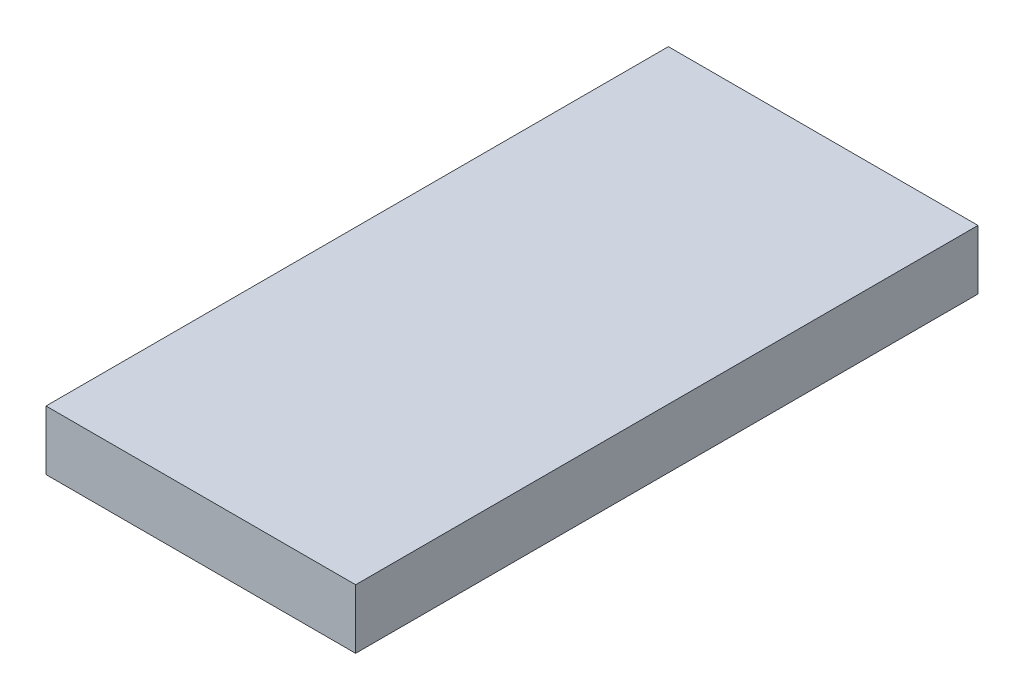
ISO-10303-21;
HEADER;
FILE_DESCRIPTION(('STEP AP214'),'2;1');
FILE_NAME('part.step','',(''),(''),'','','');
FILE_SCHEMA(('AUTOMOTIVE_DESIGN { 1 0 10303 214 1 1 1 1 }'));
ENDSEC;
DATA;
#1=APPLICATION_CONTEXT('core data for automotive mechanical design processes');
#2=APPLICATION_PROTOCOL_DEFINITION('international standard','automotive_design',2000,#1);
#3=PRODUCT_CONTEXT('',#1,'mechanical');
#4=PRODUCT('Part','Part','',(#3));
#5=PRODUCT_RELATED_PRODUCT_CATEGORY('part','',(#4));
#6=PRODUCT_DEFINITION_FORMATION('','',#4);
#7=PRODUCT_DEFINITION_CONTEXT('part definition',#1,'design');
#8=PRODUCT_DEFINITION('design','',#6,#7);
#9=PRODUCT_DEFINITION_SHAPE('','',#8);
#10=(LENGTH_UNIT() NAMED_UNIT(*) SI_UNIT(.MILLI.,.METRE.));
#11=(NAMED_UNIT(*) PLANE_ANGLE_UNIT() SI_UNIT($,.RADIAN.));
#12=(NAMED_UNIT(*) SI_UNIT($,.STERADIAN.) SOLID_ANGLE_UNIT());
#13=UNCERTAINTY_MEASURE_WITH_UNIT(LENGTH_MEASURE(1.E-05),#10,'distance_accuracy_value','');
#14=(GEOMETRIC_REPRESENTATION_CONTEXT(3) GLOBAL_UNCERTAINTY_ASSIGNED_CONTEXT((#13)) GLOBAL_UNIT_ASSIGNED_CONTEXT((#10,
#11,#12)) REPRESENTATION_CONTEXT('',''));
#15=CARTESIAN_POINT('',(0.,0.,0.));
#16=DIRECTION('',(0.,0.,1.));
#17=DIRECTION('',(1.,0.,0.));
#18=AXIS2_PLACEMENT_3D('',#15,#16,#17);
#19=CARTESIAN_POINT('',(6.2865,2.413,-12.6365));
#20=DIRECTION('',(-1.,0.,0.));
#21=DIRECTION('',(0.,0.,1.));
#22=AXIS2_PLACEMENT_3D('',#19,#20,#21);
#23=PLANE('',#22);
#24=DIRECTION('',(0.,0.,-1.));
#25=VECTOR('',#24,1.);
#26=CARTESIAN_POINT('',(6.2865,0.,-12.6365));
#27=LINE('',#26,#25);
#28=CARTESIAN_POINT('',(6.2865,0.,12.6365));
#29=VERTEX_POINT('',#28);
#30=CARTESIAN_POINT('',(6.2865,0.,-12.6365));
#31=VERTEX_POINT('',#30);
#32=EDGE_CURVE('E96',#29,#31,#27,.T.);
#33=ORIENTED_EDGE('',*,*,#32,.T.);
#34=DIRECTION('',(0.,-1.,0.));
#35=VECTOR('',#34,1.);
#36=CARTESIAN_POINT('',(6.2865,2.413,-12.6365));
#37=LINE('',#36,#35);
#38=CARTESIAN_POINT('',(6.2865,2.413,-12.6365));
#39=VERTEX_POINT('',#38);
#40=EDGE_CURVE('E11',#39,#31,#37,.T.);
#41=ORIENTED_EDGE('',*,*,#40,.F.);
#42=DIRECTION('',(0.,0.,-1.));
#43=VECTOR('',#42,1.);
#44=CARTESIAN_POINT('',(6.2865,2.413,-12.6365));
#45=LINE('',#44,#43);
#46=CARTESIAN_POINT('',(6.2865,2.413,12.6365));
#47=VERTEX_POINT('',#46);
#48=EDGE_CURVE('E84',#47,#39,#45,.T.);
#49=ORIENTED_EDGE('',*,*,#48,.F.);
#50=DIRECTION('',(0.,-1.,0.));
#51=VECTOR('',#50,1.);
#52=CARTESIAN_POINT('',(6.2865,2.413,12.6365));
#53=LINE('',#52,#51);
#54=EDGE_CURVE('E92',#47,#29,#53,.T.);
#55=ORIENTED_EDGE('',*,*,#54,.T.);
#56=EDGE_LOOP('',(#33,#41,#49,#55));
#57=FACE_BOUND('',#56,.T.);
#58=ADVANCED_FACE('F33',(#57),#23,.F.);
#59=CARTESIAN_POINT('',(-6.2865,2.413,-12.6365));
#60=DIRECTION('',(0.,0.,1.));
#61=DIRECTION('',(1.,0.,0.));
#62=AXIS2_PLACEMENT_3D('',#59,#60,#61);
#63=PLANE('',#62);
#64=DIRECTION('',(-1.,0.,0.));
#65=VECTOR('',#64,1.);
#66=CARTESIAN_POINT('',(-6.2865,0.,-12.6365));
#67=LINE('',#66,#65);
#68=CARTESIAN_POINT('',(-6.2865,0.,-12.6365));
#69=VERTEX_POINT('',#68);
#70=EDGE_CURVE('E88',#31,#69,#67,.T.);
#71=ORIENTED_EDGE('',*,*,#70,.T.);
#72=DIRECTION('',(0.,-1.,0.));
#73=VECTOR('',#72,1.);
#74=CARTESIAN_POINT('',(-6.2865,2.413,-12.6365));
#75=LINE('',#74,#73);
#76=CARTESIAN_POINT('',(-6.2865,2.413,-12.6365));
#77=VERTEX_POINT('',#76);
#78=EDGE_CURVE('E41',#77,#69,#75,.T.);
#79=ORIENTED_EDGE('',*,*,#78,.F.);
#80=DIRECTION('',(-1.,0.,0.));
#81=VECTOR('',#80,1.);
#82=CARTESIAN_POINT('',(-6.2865,2.413,-12.6365));
#83=LINE('',#82,#81);
#84=EDGE_CURVE('E79',#39,#77,#83,.T.);
#85=ORIENTED_EDGE('',*,*,#84,.F.);
#86=ORIENTED_EDGE('',*,*,#40,.T.);
#87=EDGE_LOOP('',(#71,#79,#85,#86));
#88=FACE_BOUND('',#87,.T.);
#89=ADVANCED_FACE('F87',(#88),#63,.F.);
#90=CARTESIAN_POINT('',(-6.2865,2.413,-12.6365));
#91=DIRECTION('',(1.,0.,0.));
#92=DIRECTION('',(0.,0.,-1.));
#93=AXIS2_PLACEMENT_3D('',#90,#91,#92);
#94=PLANE('',#93);
#95=DIRECTION('',(0.,0.,1.));
#96=VECTOR('',#95,1.);
#97=CARTESIAN_POINT('',(-6.2865,0.,-12.6365));
#98=LINE('',#97,#96);
#99=CARTESIAN_POINT('',(-6.2865,0.,12.6365));
#100=VERTEX_POINT('',#99);
#101=EDGE_CURVE('E66',#69,#100,#98,.T.);
#102=ORIENTED_EDGE('',*,*,#101,.T.);
#103=DIRECTION('',(0.,-1.,0.));
#104=VECTOR('',#103,1.);
#105=CARTESIAN_POINT('',(-6.2865,2.413,12.6365));
#106=LINE('',#105,#104);
#107=CARTESIAN_POINT('',(-6.2865,2.413,12.6365));
#108=VERTEX_POINT('',#107);
#109=EDGE_CURVE('E89',#108,#100,#106,.T.);
#110=ORIENTED_EDGE('',*,*,#109,.F.);
#111=DIRECTION('',(0.,0.,1.));
#112=VECTOR('',#111,1.);
#113=CARTESIAN_POINT('',(-6.2865,2.413,-12.6365));
#114=LINE('',#113,#112);
#115=EDGE_CURVE('E82',#77,#108,#114,.T.);
#116=ORIENTED_EDGE('',*,*,#115,.F.);
#117=ORIENTED_EDGE('',*,*,#78,.T.);
#118=EDGE_LOOP('',(#102,#110,#116,#117));
#119=FACE_BOUND('',#118,.T.);
#120=ADVANCED_FACE('F90',(#119),#94,.F.);
#121=CARTESIAN_POINT('',(-6.2865,2.413,12.6365));
#122=DIRECTION('',(0.,0.,-1.));
#123=DIRECTION('',(-1.,0.,0.));
#124=AXIS2_PLACEMENT_3D('',#121,#122,#123);
#125=PLANE('',#124);
#126=DIRECTION('',(1.,0.,0.));
#127=VECTOR('',#126,1.);
#128=CARTESIAN_POINT('',(-6.2865,0.,12.6365));
#129=LINE('',#128,#127);
#130=EDGE_CURVE('E72',#100,#29,#129,.T.);
#131=ORIENTED_EDGE('',*,*,#130,.T.);
#132=ORIENTED_EDGE('',*,*,#54,.F.);
#133=DIRECTION('',(1.,0.,0.));
#134=VECTOR('',#133,1.);
#135=CARTESIAN_POINT('',(-6.2865,2.413,12.6365));
#136=LINE('',#135,#134);
#137=EDGE_CURVE('E49',#108,#47,#136,.T.);
#138=ORIENTED_EDGE('',*,*,#137,.F.);
#139=ORIENTED_EDGE('',*,*,#109,.T.);
#140=EDGE_LOOP('',(#131,#132,#138,#139));
#141=FACE_BOUND('',#140,.T.);
#142=ADVANCED_FACE('F103',(#141),#125,.F.);
#143=CARTESIAN_POINT('',(0.,2.413,0.));
#144=DIRECTION('',(0.,1.,0.));
#145=DIRECTION('',(0.,0.,1.));
#146=AXIS2_PLACEMENT_3D('',#143,#144,#145);
#147=PLANE('',#146);
#148=ORIENTED_EDGE('',*,*,#48,.T.);
#149=ORIENTED_EDGE('',*,*,#84,.T.);
#150=ORIENTED_EDGE('',*,*,#115,.T.);
#151=ORIENTED_EDGE('',*,*,#137,.T.);
#152=EDGE_LOOP('',(#148,#149,#150,#151));
#153=FACE_BOUND('',#152,.T.);
#154=ADVANCED_FACE('F80',(#153),#147,.T.);
#155=CARTESIAN_POINT('',(0.,0.,0.));
#156=DIRECTION('',(0.,1.,0.));
#157=DIRECTION('',(0.,0.,1.));
#158=AXIS2_PLACEMENT_3D('',#155,#156,#157);
#159=PLANE('',#158);
#160=ORIENTED_EDGE('',*,*,#32,.F.);
#161=ORIENTED_EDGE('',*,*,#130,.F.);
#162=ORIENTED_EDGE('',*,*,#101,.F.);
#163=ORIENTED_EDGE('',*,*,#70,.F.);
#164=EDGE_LOOP('',(#160,#161,#162,#163));
#165=FACE_BOUND('',#164,.T.);
#166=ADVANCED_FACE('F106',(#165),#159,.F.);
#167=CLOSED_SHELL('',(#58,#89,#120,#142,#154,#166));
#168=MANIFOLD_SOLID_BREP('B2',#167);
#169=ADVANCED_BREP_SHAPE_REPRESENTATION('',(#18,#168),#14);
#170=SHAPE_DEFINITION_REPRESENTATION(#9,#169);
ENDSEC;
END-ISO-10303-21;
